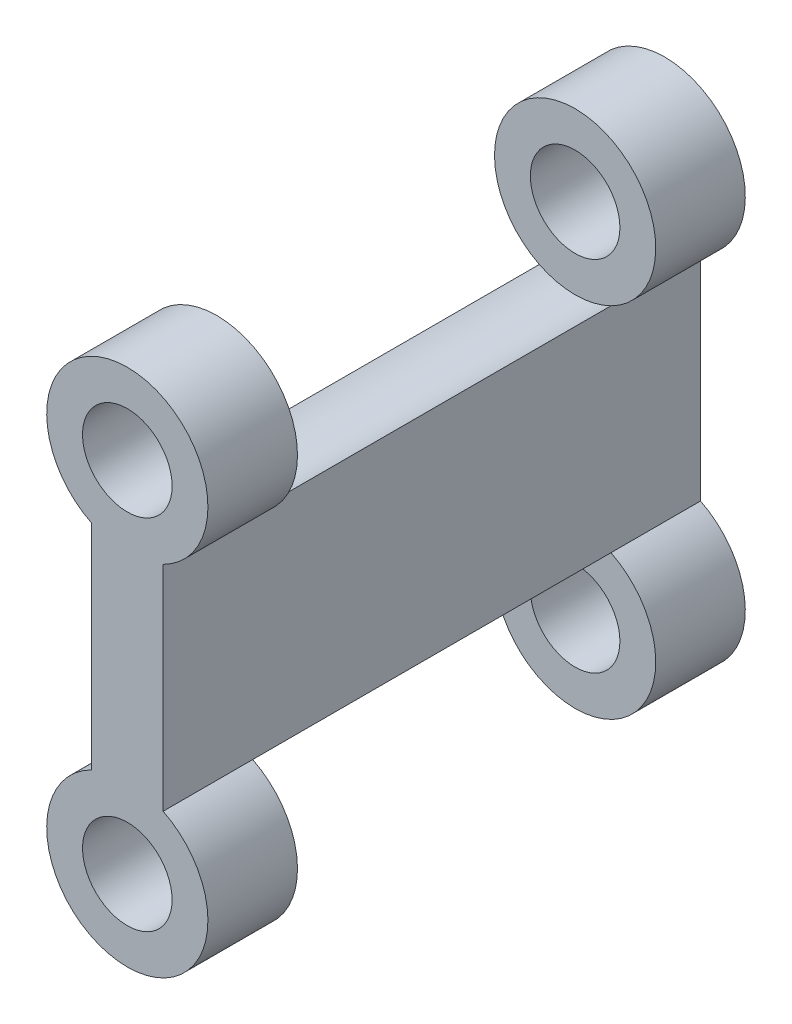
ISO-10303-21;
HEADER;
FILE_DESCRIPTION(('STEP AP214'),'2;1');
FILE_NAME('part.step','',(''),(''),'','','');
FILE_SCHEMA(('AUTOMOTIVE_DESIGN { 1 0 10303 214 1 1 1 1 }'));
ENDSEC;
DATA;
#1=APPLICATION_CONTEXT('core data for automotive mechanical design processes');
#2=APPLICATION_PROTOCOL_DEFINITION('international standard','automotive_design',2000,#1);
#3=PRODUCT_CONTEXT('',#1,'mechanical');
#4=PRODUCT('Part','Part','',(#3));
#5=PRODUCT_RELATED_PRODUCT_CATEGORY('part','',(#4));
#6=PRODUCT_DEFINITION_FORMATION('','',#4);
#7=PRODUCT_DEFINITION_CONTEXT('part definition',#1,'design');
#8=PRODUCT_DEFINITION('design','',#6,#7);
#9=PRODUCT_DEFINITION_SHAPE('','',#8);
#10=(LENGTH_UNIT() NAMED_UNIT(*) SI_UNIT(.MILLI.,.METRE.));
#11=(NAMED_UNIT(*) PLANE_ANGLE_UNIT() SI_UNIT($,.RADIAN.));
#12=(NAMED_UNIT(*) SI_UNIT($,.STERADIAN.) SOLID_ANGLE_UNIT());
#13=UNCERTAINTY_MEASURE_WITH_UNIT(LENGTH_MEASURE(1.E-05),#10,'distance_accuracy_value','');
#14=(GEOMETRIC_REPRESENTATION_CONTEXT(3) GLOBAL_UNCERTAINTY_ASSIGNED_CONTEXT((#13)) GLOBAL_UNIT_ASSIGNED_CONTEXT((#10,
#11,#12)) REPRESENTATION_CONTEXT('',''));
#15=CARTESIAN_POINT('',(0.,0.,0.));
#16=DIRECTION('',(0.,0.,1.));
#17=DIRECTION('',(1.,0.,0.));
#18=AXIS2_PLACEMENT_3D('',#15,#16,#17);
#19=CARTESIAN_POINT('',(0.,0.,19.05));
#20=DIRECTION('',(0.,0.,-1.));
#21=DIRECTION('',(-1.,0.,0.));
#22=AXIS2_PLACEMENT_3D('',#19,#20,#21);
#23=CYLINDRICAL_SURFACE('',#22,5.715);
#24=CARTESIAN_POINT('',(0.,0.,-12.7));
#25=DIRECTION('',(0.,0.,1.));
#26=DIRECTION('',(1.,0.,0.));
#27=AXIS2_PLACEMENT_3D('',#24,#25,#26);
#28=CIRCLE('',#27,5.715);
#29=CARTESIAN_POINT('',(-2.54,5.11953367016958,-12.7));
#30=VERTEX_POINT('',#29);
#31=CARTESIAN_POINT('',(2.54,5.11953367016958,-12.7));
#32=VERTEX_POINT('',#31);
#33=EDGE_CURVE('E213',#30,#32,#28,.T.);
#34=ORIENTED_EDGE('',*,*,#33,.F.);
#35=DIRECTION('',(0.,0.,-1.));
#36=VECTOR('',#35,1.);
#37=CARTESIAN_POINT('',(-2.54,5.11953367016958,19.05));
#38=LINE('',#37,#36);
#39=CARTESIAN_POINT('',(-2.54,5.11953367016958,-19.05));
#40=VERTEX_POINT('',#39);
#41=EDGE_CURVE('E134',#30,#40,#38,.T.);
#42=ORIENTED_EDGE('',*,*,#41,.T.);
#43=CARTESIAN_POINT('',(0.,0.,-19.05));
#44=DIRECTION('',(0.,0.,1.));
#45=DIRECTION('',(1.,0.,0.));
#46=AXIS2_PLACEMENT_3D('',#43,#44,#45);
#47=CIRCLE('',#46,5.715);
#48=CARTESIAN_POINT('',(2.54,5.11953367016958,-19.05));
#49=VERTEX_POINT('',#48);
#50=EDGE_CURVE('E155',#40,#49,#47,.T.);
#51=ORIENTED_EDGE('',*,*,#50,.T.);
#52=DIRECTION('',(0.,0.,-1.));
#53=VECTOR('',#52,1.);
#54=CARTESIAN_POINT('',(2.54,5.11953367016958,19.05));
#55=LINE('',#54,#53);
#56=EDGE_CURVE('E43',#32,#49,#55,.T.);
#57=ORIENTED_EDGE('',*,*,#56,.F.);
#58=EDGE_LOOP('',(#34,#42,#51,#57));
#59=FACE_BOUND('',#58,.T.);
#60=ADVANCED_FACE('F35',(#59),#23,.T.);
#61=CARTESIAN_POINT('',(0.,25.4,19.05));
#62=DIRECTION('',(0.,0.,-1.));
#63=DIRECTION('',(-1.,0.,0.));
#64=AXIS2_PLACEMENT_3D('',#61,#62,#63);
#65=CYLINDRICAL_SURFACE('',#64,5.715);
#66=CARTESIAN_POINT('',(0.,25.4,-12.7));
#67=DIRECTION('',(0.,0.,1.));
#68=DIRECTION('',(1.,0.,0.));
#69=AXIS2_PLACEMENT_3D('',#66,#67,#68);
#70=CIRCLE('',#69,5.715);
#71=CARTESIAN_POINT('',(2.54,20.2804663298304,-12.7));
#72=VERTEX_POINT('',#71);
#73=CARTESIAN_POINT('',(-2.54,20.2804663298304,-12.7));
#74=VERTEX_POINT('',#73);
#75=EDGE_CURVE('E200',#72,#74,#70,.T.);
#76=ORIENTED_EDGE('',*,*,#75,.F.);
#77=DIRECTION('',(0.,0.,-1.));
#78=VECTOR('',#77,1.);
#79=CARTESIAN_POINT('',(2.54,20.2804663298304,19.05));
#80=LINE('',#79,#78);
#81=CARTESIAN_POINT('',(2.54,20.2804663298304,-19.05));
#82=VERTEX_POINT('',#81);
#83=EDGE_CURVE('E127',#72,#82,#80,.T.);
#84=ORIENTED_EDGE('',*,*,#83,.T.);
#85=CARTESIAN_POINT('',(0.,25.4,-19.05));
#86=DIRECTION('',(0.,0.,1.));
#87=DIRECTION('',(1.,0.,0.));
#88=AXIS2_PLACEMENT_3D('',#85,#86,#87);
#89=CIRCLE('',#88,5.715);
#90=CARTESIAN_POINT('',(-2.54,20.2804663298304,-19.05));
#91=VERTEX_POINT('',#90);
#92=EDGE_CURVE('E161',#82,#91,#89,.T.);
#93=ORIENTED_EDGE('',*,*,#92,.T.);
#94=DIRECTION('',(0.,0.,-1.));
#95=VECTOR('',#94,1.);
#96=CARTESIAN_POINT('',(-2.54,20.2804663298304,19.05));
#97=LINE('',#96,#95);
#98=EDGE_CURVE('E107',#74,#91,#97,.T.);
#99=ORIENTED_EDGE('',*,*,#98,.F.);
#100=EDGE_LOOP('',(#76,#84,#93,#99));
#101=FACE_BOUND('',#100,.T.);
#102=ADVANCED_FACE('F199',(#101),#65,.T.);
#103=CARTESIAN_POINT('',(0.,0.,19.05));
#104=DIRECTION('',(0.,0.,-1.));
#105=DIRECTION('',(-1.,0.,0.));
#106=AXIS2_PLACEMENT_3D('',#103,#104,#105);
#107=CYLINDRICAL_SURFACE('',#106,3.175);
#108=CARTESIAN_POINT('',(0.,0.,-19.05));
#109=DIRECTION('',(0.,0.,1.));
#110=DIRECTION('',(1.,0.,0.));
#111=AXIS2_PLACEMENT_3D('',#108,#109,#110);
#112=CIRCLE('',#111,3.175);
#113=CARTESIAN_POINT('',(3.175,0.,-19.05));
#114=VERTEX_POINT('',#113);
#115=EDGE_CURVE('E152',#114,#114,#112,.T.);
#116=ORIENTED_EDGE('',*,*,#115,.F.);
#117=EDGE_LOOP('',(#116));
#118=FACE_BOUND('',#117,.T.);
#119=CARTESIAN_POINT('',(0.,0.,-12.7));
#120=DIRECTION('',(0.,0.,1.));
#121=DIRECTION('',(1.,0.,0.));
#122=AXIS2_PLACEMENT_3D('',#119,#120,#121);
#123=CIRCLE('',#122,3.175);
#124=CARTESIAN_POINT('',(3.175,0.,-12.7));
#125=VERTEX_POINT('',#124);
#126=EDGE_CURVE('E217',#125,#125,#123,.T.);
#127=ORIENTED_EDGE('',*,*,#126,.T.);
#128=EDGE_LOOP('',(#127));
#129=FACE_BOUND('',#128,.T.);
#130=ADVANCED_FACE('F226',(#118,#129),#107,.F.);
#131=CARTESIAN_POINT('',(0.,25.4,19.05));
#132=DIRECTION('',(0.,0.,-1.));
#133=DIRECTION('',(-1.,0.,0.));
#134=AXIS2_PLACEMENT_3D('',#131,#132,#133);
#135=CYLINDRICAL_SURFACE('',#134,3.175);
#136=CARTESIAN_POINT('',(0.,25.4,-19.05));
#137=DIRECTION('',(0.,0.,1.));
#138=DIRECTION('',(1.,0.,0.));
#139=AXIS2_PLACEMENT_3D('',#136,#137,#138);
#140=CIRCLE('',#139,3.175);
#141=CARTESIAN_POINT('',(3.175,25.4,-19.05));
#142=VERTEX_POINT('',#141);
#143=EDGE_CURVE('E164',#142,#142,#140,.T.);
#144=ORIENTED_EDGE('',*,*,#143,.F.);
#145=EDGE_LOOP('',(#144));
#146=FACE_BOUND('',#145,.T.);
#147=CARTESIAN_POINT('',(0.,25.4,-12.7));
#148=DIRECTION('',(0.,0.,1.));
#149=DIRECTION('',(1.,0.,0.));
#150=AXIS2_PLACEMENT_3D('',#147,#148,#149);
#151=CIRCLE('',#150,3.175);
#152=CARTESIAN_POINT('',(3.175,25.4,-12.7));
#153=VERTEX_POINT('',#152);
#154=EDGE_CURVE('E203',#153,#153,#151,.T.);
#155=ORIENTED_EDGE('',*,*,#154,.T.);
#156=EDGE_LOOP('',(#155));
#157=FACE_BOUND('',#156,.T.);
#158=ADVANCED_FACE('F247',(#146,#157),#135,.F.);
#159=CARTESIAN_POINT('',(-2.54,5.11953367016958,19.05));
#160=VERTEX_POINT('',#159);
#161=CARTESIAN_POINT('',(-2.54,5.11953367016958,12.7));
#162=VERTEX_POINT('',#161);
#163=EDGE_CURVE('E129',#160,#162,#38,.T.);
#164=ORIENTED_EDGE('',*,*,#163,.T.);
#165=CARTESIAN_POINT('',(0.,0.,12.7));
#166=DIRECTION('',(0.,0.,1.));
#167=DIRECTION('',(1.,0.,0.));
#168=AXIS2_PLACEMENT_3D('',#165,#166,#167);
#169=CIRCLE('',#168,5.715);
#170=CARTESIAN_POINT('',(2.54,5.11953367016958,12.7));
#171=VERTEX_POINT('',#170);
#172=EDGE_CURVE('E220',#162,#171,#169,.T.);
#173=ORIENTED_EDGE('',*,*,#172,.T.);
#174=CARTESIAN_POINT('',(2.54,5.11953367016958,19.05));
#175=VERTEX_POINT('',#174);
#176=EDGE_CURVE('E11',#175,#171,#55,.T.);
#177=ORIENTED_EDGE('',*,*,#176,.F.);
#178=CARTESIAN_POINT('',(0.,0.,19.05));
#179=DIRECTION('',(0.,0.,1.));
#180=DIRECTION('',(1.,0.,0.));
#181=AXIS2_PLACEMENT_3D('',#178,#179,#180);
#182=CIRCLE('',#181,5.715);
#183=EDGE_CURVE('E170',#160,#175,#182,.T.);
#184=ORIENTED_EDGE('',*,*,#183,.F.);
#185=EDGE_LOOP('',(#164,#173,#177,#184));
#186=FACE_BOUND('',#185,.T.);
#187=ADVANCED_FACE('F240',(#186),#23,.T.);
#188=CARTESIAN_POINT('',(2.54,0.,19.05));
#189=DIRECTION('',(1.,0.,0.));
#190=DIRECTION('',(0.,1.,0.));
#191=AXIS2_PLACEMENT_3D('',#188,#189,#190);
#192=PLANE('',#191);
#193=DIRECTION('',(0.,-1.,0.));
#194=VECTOR('',#193,1.);
#195=CARTESIAN_POINT('',(2.54,0.,-19.05));
#196=LINE('',#195,#194);
#197=EDGE_CURVE('E158',#82,#49,#196,.T.);
#198=ORIENTED_EDGE('',*,*,#197,.F.);
#199=ORIENTED_EDGE('',*,*,#83,.F.);
#200=DIRECTION('',(0.,0.,1.));
#201=VECTOR('',#200,1.);
#202=CARTESIAN_POINT('',(2.54,20.2804663298304,-12.7));
#203=LINE('',#202,#201);
#204=CARTESIAN_POINT('',(2.54,20.2804663298304,12.7));
#205=VERTEX_POINT('',#204);
#206=EDGE_CURVE('E190',#205,#72,#203,.F.);
#207=ORIENTED_EDGE('',*,*,#206,.F.);
#208=CARTESIAN_POINT('',(2.54,20.2804663298304,19.05));
#209=VERTEX_POINT('',#208);
#210=EDGE_CURVE('E122',#209,#205,#80,.T.);
#211=ORIENTED_EDGE('',*,*,#210,.F.);
#212=DIRECTION('',(0.,-1.,0.));
#213=VECTOR('',#212,1.);
#214=CARTESIAN_POINT('',(2.54,0.,19.05));
#215=LINE('',#214,#213);
#216=EDGE_CURVE('E174',#209,#175,#215,.T.);
#217=ORIENTED_EDGE('',*,*,#216,.T.);
#218=ORIENTED_EDGE('',*,*,#176,.T.);
#219=DIRECTION('',(0.,0.,1.));
#220=VECTOR('',#219,1.);
#221=CARTESIAN_POINT('',(2.54,5.11953367016958,-12.7));
#222=LINE('',#221,#220);
#223=EDGE_CURVE('E156',#32,#171,#222,.T.);
#224=ORIENTED_EDGE('',*,*,#223,.F.);
#225=ORIENTED_EDGE('',*,*,#56,.T.);
#226=EDGE_LOOP('',(#198,#199,#207,#211,#217,#218,#224,#225));
#227=FACE_BOUND('',#226,.T.);
#228=ADVANCED_FACE('F187',(#227),#192,.T.);
#229=ORIENTED_EDGE('',*,*,#210,.T.);
#230=CARTESIAN_POINT('',(0.,25.4,12.7));
#231=DIRECTION('',(0.,0.,1.));
#232=DIRECTION('',(1.,0.,0.));
#233=AXIS2_PLACEMENT_3D('',#230,#231,#232);
#234=CIRCLE('',#233,5.715);
#235=CARTESIAN_POINT('',(-2.54,20.2804663298304,12.7));
#236=VERTEX_POINT('',#235);
#237=EDGE_CURVE('E113',#205,#236,#234,.T.);
#238=ORIENTED_EDGE('',*,*,#237,.T.);
#239=CARTESIAN_POINT('',(-2.54,20.2804663298304,19.05));
#240=VERTEX_POINT('',#239);
#241=EDGE_CURVE('E106',#240,#236,#97,.T.);
#242=ORIENTED_EDGE('',*,*,#241,.F.);
#243=CARTESIAN_POINT('',(0.,25.4,19.05));
#244=DIRECTION('',(0.,0.,1.));
#245=DIRECTION('',(1.,0.,0.));
#246=AXIS2_PLACEMENT_3D('',#243,#244,#245);
#247=CIRCLE('',#246,5.715);
#248=EDGE_CURVE('E148',#209,#240,#247,.T.);
#249=ORIENTED_EDGE('',*,*,#248,.F.);
#250=EDGE_LOOP('',(#229,#238,#242,#249));
#251=FACE_BOUND('',#250,.T.);
#252=ADVANCED_FACE('F119',(#251),#65,.T.);
#253=CARTESIAN_POINT('',(-2.54,0.,19.05));
#254=DIRECTION('',(1.,0.,0.));
#255=DIRECTION('',(0.,1.,0.));
#256=AXIS2_PLACEMENT_3D('',#253,#254,#255);
#257=PLANE('',#256);
#258=DIRECTION('',(0.,-1.,0.));
#259=VECTOR('',#258,1.);
#260=CARTESIAN_POINT('',(-2.54,0.,-19.05));
#261=LINE('',#260,#259);
#262=EDGE_CURVE('E163',#91,#40,#261,.T.);
#263=ORIENTED_EDGE('',*,*,#262,.T.);
#264=ORIENTED_EDGE('',*,*,#41,.F.);
#265=EDGE_CURVE('E133',#162,#30,#38,.T.);
#266=ORIENTED_EDGE('',*,*,#265,.F.);
#267=ORIENTED_EDGE('',*,*,#163,.F.);
#268=DIRECTION('',(0.,-1.,0.));
#269=VECTOR('',#268,1.);
#270=CARTESIAN_POINT('',(-2.54,0.,19.05));
#271=LINE('',#270,#269);
#272=EDGE_CURVE('E126',#240,#160,#271,.T.);
#273=ORIENTED_EDGE('',*,*,#272,.F.);
#274=ORIENTED_EDGE('',*,*,#241,.T.);
#275=EDGE_CURVE('E99',#236,#74,#97,.T.);
#276=ORIENTED_EDGE('',*,*,#275,.T.);
#277=ORIENTED_EDGE('',*,*,#98,.T.);
#278=EDGE_LOOP('',(#263,#264,#266,#267,#273,#274,#276,#277));
#279=FACE_BOUND('',#278,.T.);
#280=ADVANCED_FACE('F124',(#279),#257,.F.);
#281=CARTESIAN_POINT('',(0.,0.,12.7));
#282=DIRECTION('',(0.,0.,1.));
#283=DIRECTION('',(1.,0.,0.));
#284=AXIS2_PLACEMENT_3D('',#281,#282,#283);
#285=CIRCLE('',#284,3.175);
#286=CARTESIAN_POINT('',(3.175,0.,12.7));
#287=VERTEX_POINT('',#286);
#288=EDGE_CURVE('E210',#287,#287,#285,.T.);
#289=ORIENTED_EDGE('',*,*,#288,.F.);
#290=EDGE_LOOP('',(#289));
#291=FACE_BOUND('',#290,.T.);
#292=CARTESIAN_POINT('',(0.,0.,19.05));
#293=DIRECTION('',(0.,0.,1.));
#294=DIRECTION('',(1.,0.,0.));
#295=AXIS2_PLACEMENT_3D('',#292,#293,#294);
#296=CIRCLE('',#295,3.175);
#297=CARTESIAN_POINT('',(3.175,0.,19.05));
#298=VERTEX_POINT('',#297);
#299=EDGE_CURVE('E166',#298,#298,#296,.T.);
#300=ORIENTED_EDGE('',*,*,#299,.T.);
#301=EDGE_LOOP('',(#300));
#302=FACE_BOUND('',#301,.T.);
#303=ADVANCED_FACE('F37',(#291,#302),#107,.F.);
#304=CARTESIAN_POINT('',(0.,25.4,12.7));
#305=DIRECTION('',(0.,0.,1.));
#306=DIRECTION('',(1.,0.,0.));
#307=AXIS2_PLACEMENT_3D('',#304,#305,#306);
#308=CIRCLE('',#307,3.175);
#309=CARTESIAN_POINT('',(3.175,25.4,12.7));
#310=VERTEX_POINT('',#309);
#311=EDGE_CURVE('E114',#310,#310,#308,.T.);
#312=ORIENTED_EDGE('',*,*,#311,.F.);
#313=EDGE_LOOP('',(#312));
#314=FACE_BOUND('',#313,.T.);
#315=CARTESIAN_POINT('',(0.,25.4,19.05));
#316=DIRECTION('',(0.,0.,1.));
#317=DIRECTION('',(1.,0.,0.));
#318=AXIS2_PLACEMENT_3D('',#315,#316,#317);
#319=CIRCLE('',#318,3.175);
#320=CARTESIAN_POINT('',(3.175,25.4,19.05));
#321=VERTEX_POINT('',#320);
#322=EDGE_CURVE('E139',#321,#321,#319,.T.);
#323=ORIENTED_EDGE('',*,*,#322,.T.);
#324=EDGE_LOOP('',(#323));
#325=FACE_BOUND('',#324,.T.);
#326=ADVANCED_FACE('F254',(#314,#325),#135,.F.);
#327=CARTESIAN_POINT('',(0.,0.,19.05));
#328=DIRECTION('',(0.,0.,1.));
#329=DIRECTION('',(1.,0.,0.));
#330=AXIS2_PLACEMENT_3D('',#327,#328,#329);
#331=PLANE('',#330);
#332=ORIENTED_EDGE('',*,*,#299,.F.);
#333=EDGE_LOOP('',(#332));
#334=FACE_BOUND('',#333,.T.);
#335=ORIENTED_EDGE('',*,*,#183,.T.);
#336=ORIENTED_EDGE('',*,*,#216,.F.);
#337=ORIENTED_EDGE('',*,*,#248,.T.);
#338=ORIENTED_EDGE('',*,*,#272,.T.);
#339=EDGE_LOOP('',(#335,#336,#337,#338));
#340=FACE_BOUND('',#339,.T.);
#341=ORIENTED_EDGE('',*,*,#322,.F.);
#342=EDGE_LOOP('',(#341));
#343=FACE_BOUND('',#342,.T.);
#344=ADVANCED_FACE('F182',(#334,#340,#343),#331,.T.);
#345=CARTESIAN_POINT('',(0.,0.,-19.05));
#346=DIRECTION('',(0.,0.,1.));
#347=DIRECTION('',(1.,0.,0.));
#348=AXIS2_PLACEMENT_3D('',#345,#346,#347);
#349=PLANE('',#348);
#350=ORIENTED_EDGE('',*,*,#115,.T.);
#351=EDGE_LOOP('',(#350));
#352=FACE_BOUND('',#351,.T.);
#353=ORIENTED_EDGE('',*,*,#50,.F.);
#354=ORIENTED_EDGE('',*,*,#262,.F.);
#355=ORIENTED_EDGE('',*,*,#92,.F.);
#356=ORIENTED_EDGE('',*,*,#197,.T.);
#357=EDGE_LOOP('',(#353,#354,#355,#356));
#358=FACE_BOUND('',#357,.T.);
#359=ORIENTED_EDGE('',*,*,#143,.T.);
#360=EDGE_LOOP('',(#359));
#361=FACE_BOUND('',#360,.T.);
#362=ADVANCED_FACE('F196',(#352,#358,#361),#349,.F.);
#363=CARTESIAN_POINT('',(0.,25.4,-12.7));
#364=DIRECTION('',(0.,0.,1.));
#365=DIRECTION('',(1.,0.,0.));
#366=AXIS2_PLACEMENT_3D('',#363,#364,#365);
#367=CYLINDRICAL_SURFACE('',#366,5.715);
#368=ORIENTED_EDGE('',*,*,#206,.T.);
#369=EDGE_CURVE('E50',#74,#72,#70,.T.);
#370=ORIENTED_EDGE('',*,*,#369,.F.);
#371=ORIENTED_EDGE('',*,*,#275,.F.);
#372=EDGE_CURVE('E102',#236,#205,#234,.T.);
#373=ORIENTED_EDGE('',*,*,#372,.T.);
#374=EDGE_LOOP('',(#368,#370,#371,#373));
#375=FACE_BOUND('',#374,.T.);
#376=ADVANCED_FACE('F101',(#375),#367,.F.);
#377=CARTESIAN_POINT('',(0.,0.,-12.7));
#378=DIRECTION('',(0.,0.,1.));
#379=DIRECTION('',(1.,0.,0.));
#380=AXIS2_PLACEMENT_3D('',#377,#378,#379);
#381=PLANE('',#380);
#382=ORIENTED_EDGE('',*,*,#369,.T.);
#383=ORIENTED_EDGE('',*,*,#75,.T.);
#384=EDGE_LOOP('',(#382,#383));
#385=FACE_BOUND('',#384,.T.);
#386=ORIENTED_EDGE('',*,*,#154,.F.);
#387=EDGE_LOOP('',(#386));
#388=FACE_BOUND('',#387,.T.);
#389=ADVANCED_FACE('F273',(#385,#388),#381,.T.);
#390=CARTESIAN_POINT('',(0.,0.,12.7));
#391=DIRECTION('',(0.,0.,1.));
#392=DIRECTION('',(1.,0.,0.));
#393=AXIS2_PLACEMENT_3D('',#390,#391,#392);
#394=PLANE('',#393);
#395=ORIENTED_EDGE('',*,*,#372,.F.);
#396=ORIENTED_EDGE('',*,*,#237,.F.);
#397=EDGE_LOOP('',(#395,#396));
#398=FACE_BOUND('',#397,.T.);
#399=ORIENTED_EDGE('',*,*,#311,.T.);
#400=EDGE_LOOP('',(#399));
#401=FACE_BOUND('',#400,.T.);
#402=ADVANCED_FACE('F111',(#398,#401),#394,.F.);
#403=CARTESIAN_POINT('',(0.,0.,-12.7));
#404=DIRECTION('',(0.,0.,1.));
#405=DIRECTION('',(1.,0.,0.));
#406=AXIS2_PLACEMENT_3D('',#403,#404,#405);
#407=CYLINDRICAL_SURFACE('',#406,5.715);
#408=ORIENTED_EDGE('',*,*,#223,.T.);
#409=EDGE_CURVE('E58',#171,#162,#169,.T.);
#410=ORIENTED_EDGE('',*,*,#409,.T.);
#411=ORIENTED_EDGE('',*,*,#265,.T.);
#412=EDGE_CURVE('E211',#32,#30,#28,.T.);
#413=ORIENTED_EDGE('',*,*,#412,.F.);
#414=EDGE_LOOP('',(#408,#410,#411,#413));
#415=FACE_BOUND('',#414,.T.);
#416=ADVANCED_FACE('F231',(#415),#407,.F.);
#417=CARTESIAN_POINT('',(0.,0.,-12.7));
#418=DIRECTION('',(0.,0.,1.));
#419=DIRECTION('',(1.,0.,0.));
#420=AXIS2_PLACEMENT_3D('',#417,#418,#419);
#421=PLANE('',#420);
#422=ORIENTED_EDGE('',*,*,#126,.F.);
#423=EDGE_LOOP('',(#422));
#424=FACE_BOUND('',#423,.T.);
#425=ORIENTED_EDGE('',*,*,#412,.T.);
#426=ORIENTED_EDGE('',*,*,#33,.T.);
#427=EDGE_LOOP('',(#425,#426));
#428=FACE_BOUND('',#427,.T.);
#429=ADVANCED_FACE('F228',(#424,#428),#421,.T.);
#430=CARTESIAN_POINT('',(0.,0.,12.7));
#431=DIRECTION('',(0.,0.,1.));
#432=DIRECTION('',(1.,0.,0.));
#433=AXIS2_PLACEMENT_3D('',#430,#431,#432);
#434=PLANE('',#433);
#435=ORIENTED_EDGE('',*,*,#288,.T.);
#436=EDGE_LOOP('',(#435));
#437=FACE_BOUND('',#436,.T.);
#438=ORIENTED_EDGE('',*,*,#409,.F.);
#439=ORIENTED_EDGE('',*,*,#172,.F.);
#440=EDGE_LOOP('',(#438,#439));
#441=FACE_BOUND('',#440,.T.);
#442=ADVANCED_FACE('F230',(#437,#441),#434,.F.);
#443=CLOSED_SHELL('',(#60,#102,#130,#158,#187,#228,#252,#280,#303,#326,#344,#362,#376,#389,#402,
#416,#429,#442));
#444=MANIFOLD_SOLID_BREP('B2',#443);
#445=ADVANCED_BREP_SHAPE_REPRESENTATION('',(#18,#444),#14);
#446=SHAPE_DEFINITION_REPRESENTATION(#9,#445);
ENDSEC;
END-ISO-10303-21;
